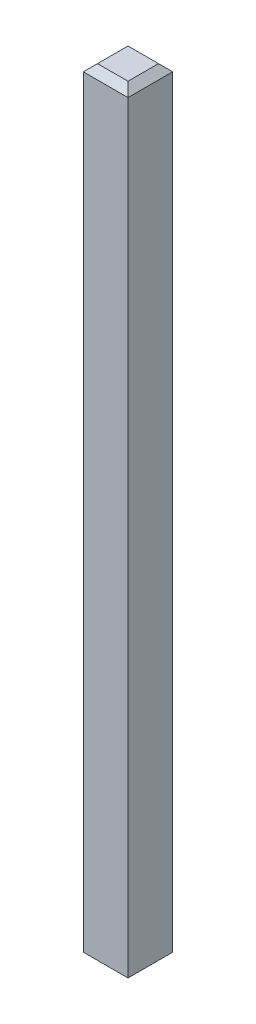
ISO-10303-21;
HEADER;
FILE_DESCRIPTION(('STEP AP214'),'2;1');
FILE_NAME('part.step','',(''),(''),'','','');
FILE_SCHEMA(('AUTOMOTIVE_DESIGN { 1 0 10303 214 1 1 1 1 }'));
ENDSEC;
DATA;
#1=APPLICATION_CONTEXT('core data for automotive mechanical design processes');
#2=APPLICATION_PROTOCOL_DEFINITION('international standard','automotive_design',2000,#1);
#3=PRODUCT_CONTEXT('',#1,'mechanical');
#4=PRODUCT('Part','Part','',(#3));
#5=PRODUCT_RELATED_PRODUCT_CATEGORY('part','',(#4));
#6=PRODUCT_DEFINITION_FORMATION('','',#4);
#7=PRODUCT_DEFINITION_CONTEXT('part definition',#1,'design');
#8=PRODUCT_DEFINITION('design','',#6,#7);
#9=PRODUCT_DEFINITION_SHAPE('','',#8);
#10=(LENGTH_UNIT() NAMED_UNIT(*) SI_UNIT(.MILLI.,.METRE.));
#11=(NAMED_UNIT(*) PLANE_ANGLE_UNIT() SI_UNIT($,.RADIAN.));
#12=(NAMED_UNIT(*) SI_UNIT($,.STERADIAN.) SOLID_ANGLE_UNIT());
#13=UNCERTAINTY_MEASURE_WITH_UNIT(LENGTH_MEASURE(1.E-05),#10,'distance_accuracy_value','');
#14=(GEOMETRIC_REPRESENTATION_CONTEXT(3) GLOBAL_UNCERTAINTY_ASSIGNED_CONTEXT((#13)) GLOBAL_UNIT_ASSIGNED_CONTEXT((#10,
#11,#12)) REPRESENTATION_CONTEXT('',''));
#15=CARTESIAN_POINT('',(0.,0.,0.));
#16=DIRECTION('',(0.,0.,1.));
#17=DIRECTION('',(1.,0.,0.));
#18=AXIS2_PLACEMENT_3D('',#15,#16,#17);
#19=CARTESIAN_POINT('',(0.,10.95,0.215));
#20=DIRECTION('',(0.,0.707106781186545,0.707106781186551));
#21=DIRECTION('',(1.,0.,0.));
#22=AXIS2_PLACEMENT_3D('',#19,#20,#21);
#23=PLANE('',#22);
#24=DIRECTION('',(-0.577350269189624,-0.577350269189629,0.577350269189624));
#25=VECTOR('',#24,1.);
#26=CARTESIAN_POINT('',(-0.143333333333333,11.0216666666667,0.143333333333334));
#27=LINE('',#26,#25);
#28=CARTESIAN_POINT('',(-0.215,10.95,0.215));
#29=VERTEX_POINT('',#28);
#30=CARTESIAN_POINT('',(-0.315,10.85,0.315));
#31=VERTEX_POINT('',#30);
#32=EDGE_CURVE('E27',#29,#31,#27,.T.);
#33=ORIENTED_EDGE('',*,*,#32,.T.);
#34=DIRECTION('',(-1.,0.,0.));
#35=VECTOR('',#34,1.);
#36=CARTESIAN_POINT('',(-0.315,10.85,0.315));
#37=LINE('',#36,#35);
#38=CARTESIAN_POINT('',(0.315,10.85,0.315));
#39=VERTEX_POINT('',#38);
#40=EDGE_CURVE('E138',#39,#31,#37,.T.);
#41=ORIENTED_EDGE('',*,*,#40,.F.);
#42=DIRECTION('',(-0.577350269189624,0.577350269189629,-0.577350269189624));
#43=VECTOR('',#42,1.);
#44=CARTESIAN_POINT('',(0.143333333333334,11.0216666666667,0.143333333333334));
#45=LINE('',#44,#43);
#46=CARTESIAN_POINT('',(0.215,10.95,0.215));
#47=VERTEX_POINT('',#46);
#48=EDGE_CURVE('E11',#39,#47,#45,.T.);
#49=ORIENTED_EDGE('',*,*,#48,.T.);
#50=DIRECTION('',(1.,0.,0.));
#51=VECTOR('',#50,1.);
#52=CARTESIAN_POINT('',(0.315,10.95,0.215));
#53=LINE('',#52,#51);
#54=EDGE_CURVE('E141',#29,#47,#53,.T.);
#55=ORIENTED_EDGE('',*,*,#54,.F.);
#56=EDGE_LOOP('',(#33,#41,#49,#55));
#57=FACE_BOUND('',#56,.T.);
#58=ADVANCED_FACE('F17',(#57),#23,.T.);
#59=CARTESIAN_POINT('',(0.215,10.95,0.));
#60=DIRECTION('',(0.707106781186551,0.707106781186545,0.));
#61=DIRECTION('',(0.,0.,-1.));
#62=AXIS2_PLACEMENT_3D('',#59,#60,#61);
#63=PLANE('',#62);
#64=DIRECTION('',(-0.577350269189624,0.577350269189629,0.577350269189624));
#65=VECTOR('',#64,1.);
#66=CARTESIAN_POINT('',(0.143333333333334,11.0216666666667,-0.143333333333334));
#67=LINE('',#66,#65);
#68=CARTESIAN_POINT('',(0.315,10.85,-0.315));
#69=VERTEX_POINT('',#68);
#70=CARTESIAN_POINT('',(0.215,10.95,-0.215));
#71=VERTEX_POINT('',#70);
#72=EDGE_CURVE('E89',#69,#71,#67,.T.);
#73=ORIENTED_EDGE('',*,*,#72,.T.);
#74=DIRECTION('',(0.,0.,-1.));
#75=VECTOR('',#74,1.);
#76=CARTESIAN_POINT('',(0.215,10.95,-0.315));
#77=LINE('',#76,#75);
#78=EDGE_CURVE('E112',#47,#71,#77,.T.);
#79=ORIENTED_EDGE('',*,*,#78,.F.);
#80=ORIENTED_EDGE('',*,*,#48,.F.);
#81=DIRECTION('',(0.,0.,1.));
#82=VECTOR('',#81,1.);
#83=CARTESIAN_POINT('',(0.315,10.85,0.315));
#84=LINE('',#83,#82);
#85=EDGE_CURVE('E283',#69,#39,#84,.T.);
#86=ORIENTED_EDGE('',*,*,#85,.F.);
#87=EDGE_LOOP('',(#73,#79,#80,#86));
#88=FACE_BOUND('',#87,.T.);
#89=ADVANCED_FACE('F19',(#88),#63,.T.);
#90=CARTESIAN_POINT('',(-0.215,10.95,0.));
#91=DIRECTION('',(-0.707106781186551,0.707106781186545,0.));
#92=DIRECTION('',(0.,0.,1.));
#93=AXIS2_PLACEMENT_3D('',#90,#91,#92);
#94=PLANE('',#93);
#95=DIRECTION('',(-0.577350269189624,-0.577350269189629,-0.577350269189624));
#96=VECTOR('',#95,1.);
#97=CARTESIAN_POINT('',(-0.143333333333333,11.0216666666667,-0.143333333333334));
#98=LINE('',#97,#96);
#99=CARTESIAN_POINT('',(-0.215,10.95,-0.215));
#100=VERTEX_POINT('',#99);
#101=CARTESIAN_POINT('',(-0.315,10.85,-0.315));
#102=VERTEX_POINT('',#101);
#103=EDGE_CURVE('E127',#100,#102,#98,.T.);
#104=ORIENTED_EDGE('',*,*,#103,.T.);
#105=DIRECTION('',(0.,0.,-1.));
#106=VECTOR('',#105,1.);
#107=CARTESIAN_POINT('',(-0.315,10.85,-0.315));
#108=LINE('',#107,#106);
#109=EDGE_CURVE('E160',#31,#102,#108,.T.);
#110=ORIENTED_EDGE('',*,*,#109,.F.);
#111=ORIENTED_EDGE('',*,*,#32,.F.);
#112=DIRECTION('',(0.,0.,1.));
#113=VECTOR('',#112,1.);
#114=CARTESIAN_POINT('',(-0.215,10.95,0.315));
#115=LINE('',#114,#113);
#116=EDGE_CURVE('E156',#100,#29,#115,.T.);
#117=ORIENTED_EDGE('',*,*,#116,.F.);
#118=EDGE_LOOP('',(#104,#110,#111,#117));
#119=FACE_BOUND('',#118,.T.);
#120=ADVANCED_FACE('F161',(#119),#94,.T.);
#121=CARTESIAN_POINT('',(0.,10.95,-0.215));
#122=DIRECTION('',(0.,0.707106781186545,-0.707106781186551));
#123=DIRECTION('',(-1.,0.,0.));
#124=AXIS2_PLACEMENT_3D('',#121,#122,#123);
#125=PLANE('',#124);
#126=ORIENTED_EDGE('',*,*,#72,.F.);
#127=DIRECTION('',(1.,0.,0.));
#128=VECTOR('',#127,1.);
#129=CARTESIAN_POINT('',(0.315,10.85,-0.315));
#130=LINE('',#129,#128);
#131=EDGE_CURVE('E173',#102,#69,#130,.T.);
#132=ORIENTED_EDGE('',*,*,#131,.F.);
#133=ORIENTED_EDGE('',*,*,#103,.F.);
#134=DIRECTION('',(-1.,0.,0.));
#135=VECTOR('',#134,1.);
#136=CARTESIAN_POINT('',(-0.315,10.95,-0.215));
#137=LINE('',#136,#135);
#138=EDGE_CURVE('E105',#71,#100,#137,.T.);
#139=ORIENTED_EDGE('',*,*,#138,.F.);
#140=EDGE_LOOP('',(#126,#132,#133,#139));
#141=FACE_BOUND('',#140,.T.);
#142=ADVANCED_FACE('F365',(#141),#125,.T.);
#143=CARTESIAN_POINT('',(-0.315,0.1,-0.315));
#144=DIRECTION('',(0.,0.707106781186542,0.707106781186554));
#145=DIRECTION('',(1.,0.,0.));
#146=AXIS2_PLACEMENT_3D('',#143,#144,#145);
#147=PLANE('',#146);
#148=DIRECTION('',(-0.577350269189622,-0.577350269189633,0.577350269189623));
#149=VECTOR('',#148,1.);
#150=CARTESIAN_POINT('',(0.315,0.1,-0.315));
#151=LINE('',#150,#149);
#152=CARTESIAN_POINT('',(0.315,0.1,-0.315));
#153=VERTEX_POINT('',#152);
#154=CARTESIAN_POINT('',(0.215,0.,-0.215));
#155=VERTEX_POINT('',#154);
#156=EDGE_CURVE('E90',#153,#155,#151,.T.);
#157=ORIENTED_EDGE('',*,*,#156,.T.);
#158=DIRECTION('',(1.,0.,0.));
#159=VECTOR('',#158,1.);
#160=CARTESIAN_POINT('',(0.,0.,-0.215));
#161=LINE('',#160,#159);
#162=CARTESIAN_POINT('',(-0.215,0.,-0.215));
#163=VERTEX_POINT('',#162);
#164=EDGE_CURVE('E93',#163,#155,#161,.T.);
#165=ORIENTED_EDGE('',*,*,#164,.F.);
#166=DIRECTION('',(-0.577350269189622,0.577350269189632,-0.577350269189622));
#167=VECTOR('',#166,1.);
#168=CARTESIAN_POINT('',(-0.315,0.1,-0.315));
#169=LINE('',#168,#167);
#170=CARTESIAN_POINT('',(-0.315,0.1,-0.315));
#171=VERTEX_POINT('',#170);
#172=EDGE_CURVE('E77',#163,#171,#169,.T.);
#173=ORIENTED_EDGE('',*,*,#172,.T.);
#174=DIRECTION('',(-1.,0.,0.));
#175=VECTOR('',#174,1.);
#176=CARTESIAN_POINT('',(-0.315,0.1,-0.315));
#177=LINE('',#176,#175);
#178=EDGE_CURVE('E280',#153,#171,#177,.T.);
#179=ORIENTED_EDGE('',*,*,#178,.F.);
#180=EDGE_LOOP('',(#157,#165,#173,#179));
#181=FACE_BOUND('',#180,.T.);
#182=ADVANCED_FACE('F94',(#181),#147,.F.);
#183=CARTESIAN_POINT('',(-0.315,0.1,-0.315));
#184=DIRECTION('',(0.707106781186554,0.707106781186542,0.));
#185=DIRECTION('',(0.,0.,-1.));
#186=AXIS2_PLACEMENT_3D('',#183,#184,#185);
#187=PLANE('',#186);
#188=DIRECTION('',(-0.577350269189622,0.577350269189633,0.577350269189623));
#189=VECTOR('',#188,1.);
#190=CARTESIAN_POINT('',(-0.315,0.1,0.315));
#191=LINE('',#190,#189);
#192=CARTESIAN_POINT('',(-0.215,0.,0.215));
#193=VERTEX_POINT('',#192);
#194=CARTESIAN_POINT('',(-0.315,0.1,0.315));
#195=VERTEX_POINT('',#194);
#196=EDGE_CURVE('E120',#193,#195,#191,.T.);
#197=ORIENTED_EDGE('',*,*,#196,.T.);
#198=DIRECTION('',(0.,0.,1.));
#199=VECTOR('',#198,1.);
#200=CARTESIAN_POINT('',(-0.315,0.1,-0.315));
#201=LINE('',#200,#199);
#202=EDGE_CURVE('E84',#171,#195,#201,.T.);
#203=ORIENTED_EDGE('',*,*,#202,.F.);
#204=ORIENTED_EDGE('',*,*,#172,.F.);
#205=DIRECTION('',(0.,0.,-1.));
#206=VECTOR('',#205,1.);
#207=CARTESIAN_POINT('',(-0.215,0.,0.));
#208=LINE('',#207,#206);
#209=EDGE_CURVE('E82',#193,#163,#208,.T.);
#210=ORIENTED_EDGE('',*,*,#209,.F.);
#211=EDGE_LOOP('',(#197,#203,#204,#210));
#212=FACE_BOUND('',#211,.T.);
#213=ADVANCED_FACE('F80',(#212),#187,.F.);
#214=CARTESIAN_POINT('',(0.315,0.1,-0.315));
#215=DIRECTION('',(-0.707106781186554,0.707106781186542,0.));
#216=DIRECTION('',(0.,0.,1.));
#217=AXIS2_PLACEMENT_3D('',#214,#215,#216);
#218=PLANE('',#217);
#219=DIRECTION('',(-0.577350269189622,-0.577350269189632,-0.577350269189622));
#220=VECTOR('',#219,1.);
#221=CARTESIAN_POINT('',(0.105000000000002,-0.11,0.105000000000002));
#222=LINE('',#221,#220);
#223=CARTESIAN_POINT('',(0.315,0.1,0.315));
#224=VERTEX_POINT('',#223);
#225=CARTESIAN_POINT('',(0.215,0.,0.215));
#226=VERTEX_POINT('',#225);
#227=EDGE_CURVE('E40',#224,#226,#222,.T.);
#228=ORIENTED_EDGE('',*,*,#227,.T.);
#229=DIRECTION('',(0.,0.,1.));
#230=VECTOR('',#229,1.);
#231=CARTESIAN_POINT('',(0.215,0.,0.));
#232=LINE('',#231,#230);
#233=EDGE_CURVE('E99',#155,#226,#232,.T.);
#234=ORIENTED_EDGE('',*,*,#233,.F.);
#235=ORIENTED_EDGE('',*,*,#156,.F.);
#236=DIRECTION('',(0.,0.,-1.));
#237=VECTOR('',#236,1.);
#238=CARTESIAN_POINT('',(0.315,0.1,-0.315));
#239=LINE('',#238,#237);
#240=EDGE_CURVE('E294',#224,#153,#239,.T.);
#241=ORIENTED_EDGE('',*,*,#240,.F.);
#242=EDGE_LOOP('',(#228,#234,#235,#241));
#243=FACE_BOUND('',#242,.T.);
#244=ADVANCED_FACE('F360',(#243),#218,.F.);
#245=CARTESIAN_POINT('',(-0.315,0.1,0.315));
#246=DIRECTION('',(0.,0.707106781186542,-0.707106781186554));
#247=DIRECTION('',(-1.,0.,0.));
#248=AXIS2_PLACEMENT_3D('',#245,#246,#247);
#249=PLANE('',#248);
#250=ORIENTED_EDGE('',*,*,#196,.F.);
#251=DIRECTION('',(-1.,0.,0.));
#252=VECTOR('',#251,1.);
#253=CARTESIAN_POINT('',(0.,0.,0.215));
#254=LINE('',#253,#252);
#255=EDGE_CURVE('E103',#226,#193,#254,.T.);
#256=ORIENTED_EDGE('',*,*,#255,.F.);
#257=ORIENTED_EDGE('',*,*,#227,.F.);
#258=DIRECTION('',(1.,0.,0.));
#259=VECTOR('',#258,1.);
#260=CARTESIAN_POINT('',(-0.315,0.1,0.315));
#261=LINE('',#260,#259);
#262=EDGE_CURVE('E157',#195,#224,#261,.T.);
#263=ORIENTED_EDGE('',*,*,#262,.F.);
#264=EDGE_LOOP('',(#250,#256,#257,#263));
#265=FACE_BOUND('',#264,.T.);
#266=ADVANCED_FACE('F359',(#265),#249,.F.);
#267=CARTESIAN_POINT('',(0.,0.,0.));
#268=DIRECTION('',(0.,1.,0.));
#269=DIRECTION('',(1.,0.,0.));
#270=AXIS2_PLACEMENT_3D('',#267,#268,#269);
#271=PLANE('',#270);
#272=ORIENTED_EDGE('',*,*,#209,.T.);
#273=ORIENTED_EDGE('',*,*,#164,.T.);
#274=ORIENTED_EDGE('',*,*,#233,.T.);
#275=ORIENTED_EDGE('',*,*,#255,.T.);
#276=EDGE_LOOP('',(#272,#273,#274,#275));
#277=FACE_BOUND('',#276,.T.);
#278=ADVANCED_FACE('F102',(#277),#271,.F.);
#279=CARTESIAN_POINT('',(0.,10.95,0.));
#280=DIRECTION('',(0.,1.,0.));
#281=DIRECTION('',(1.,0.,0.));
#282=AXIS2_PLACEMENT_3D('',#279,#280,#281);
#283=PLANE('',#282);
#284=ORIENTED_EDGE('',*,*,#116,.T.);
#285=ORIENTED_EDGE('',*,*,#54,.T.);
#286=ORIENTED_EDGE('',*,*,#78,.T.);
#287=ORIENTED_EDGE('',*,*,#138,.T.);
#288=EDGE_LOOP('',(#284,#285,#286,#287));
#289=FACE_BOUND('',#288,.T.);
#290=ADVANCED_FACE('F366',(#289),#283,.T.);
#291=CARTESIAN_POINT('',(-0.315,10.95,0.315));
#292=DIRECTION('',(0.,0.,-1.));
#293=DIRECTION('',(0.,-1.,0.));
#294=AXIS2_PLACEMENT_3D('',#291,#292,#293);
#295=PLANE('',#294);
#296=DIRECTION('',(0.,-1.,0.));
#297=VECTOR('',#296,1.);
#298=CARTESIAN_POINT('',(-0.315,10.95,0.315));
#299=LINE('',#298,#297);
#300=EDGE_CURVE('E152',#31,#195,#299,.T.);
#301=ORIENTED_EDGE('',*,*,#300,.T.);
#302=ORIENTED_EDGE('',*,*,#262,.T.);
#303=DIRECTION('',(0.,-1.,0.));
#304=VECTOR('',#303,1.);
#305=CARTESIAN_POINT('',(0.315,10.95,0.315));
#306=LINE('',#305,#304);
#307=EDGE_CURVE('E154',#39,#224,#306,.T.);
#308=ORIENTED_EDGE('',*,*,#307,.F.);
#309=ORIENTED_EDGE('',*,*,#40,.T.);
#310=EDGE_LOOP('',(#301,#302,#308,#309));
#311=FACE_BOUND('',#310,.T.);
#312=ADVANCED_FACE('F149',(#311),#295,.F.);
#313=CARTESIAN_POINT('',(-0.315,10.95,-0.315));
#314=DIRECTION('',(1.,0.,0.));
#315=DIRECTION('',(0.,0.,-1.));
#316=AXIS2_PLACEMENT_3D('',#313,#314,#315);
#317=PLANE('',#316);
#318=DIRECTION('',(0.,-1.,0.));
#319=VECTOR('',#318,1.);
#320=CARTESIAN_POINT('',(-0.315,10.95,-0.315));
#321=LINE('',#320,#319);
#322=EDGE_CURVE('E191',#102,#171,#321,.T.);
#323=ORIENTED_EDGE('',*,*,#322,.T.);
#324=ORIENTED_EDGE('',*,*,#202,.T.);
#325=ORIENTED_EDGE('',*,*,#300,.F.);
#326=ORIENTED_EDGE('',*,*,#109,.T.);
#327=EDGE_LOOP('',(#323,#324,#325,#326));
#328=FACE_BOUND('',#327,.T.);
#329=ADVANCED_FACE('F167',(#328),#317,.F.);
#330=CARTESIAN_POINT('',(-0.315,10.95,-0.315));
#331=DIRECTION('',(0.,0.,1.));
#332=DIRECTION('',(1.,0.,0.));
#333=AXIS2_PLACEMENT_3D('',#330,#331,#332);
#334=PLANE('',#333);
#335=DIRECTION('',(0.,-1.,0.));
#336=VECTOR('',#335,1.);
#337=CARTESIAN_POINT('',(0.315,10.95,-0.315));
#338=LINE('',#337,#336);
#339=EDGE_CURVE('E287',#69,#153,#338,.T.);
#340=ORIENTED_EDGE('',*,*,#339,.T.);
#341=ORIENTED_EDGE('',*,*,#178,.T.);
#342=ORIENTED_EDGE('',*,*,#322,.F.);
#343=ORIENTED_EDGE('',*,*,#131,.T.);
#344=EDGE_LOOP('',(#340,#341,#342,#343));
#345=FACE_BOUND('',#344,.T.);
#346=ADVANCED_FACE('F363',(#345),#334,.F.);
#347=CARTESIAN_POINT('',(0.315,10.95,-0.315));
#348=DIRECTION('',(-1.,0.,0.));
#349=DIRECTION('',(0.,1.,0.));
#350=AXIS2_PLACEMENT_3D('',#347,#348,#349);
#351=PLANE('',#350);
#352=ORIENTED_EDGE('',*,*,#307,.T.);
#353=ORIENTED_EDGE('',*,*,#240,.T.);
#354=ORIENTED_EDGE('',*,*,#339,.F.);
#355=ORIENTED_EDGE('',*,*,#85,.T.);
#356=EDGE_LOOP('',(#352,#353,#354,#355));
#357=FACE_BOUND('',#356,.T.);
#358=ADVANCED_FACE('F326',(#357),#351,.F.);
#359=CLOSED_SHELL('',(#58,#89,#120,#142,#182,#213,#244,#266,#278,#290,#312,#329,#346,#358));
#360=MANIFOLD_SOLID_BREP('B1',#359);
#361=ADVANCED_BREP_SHAPE_REPRESENTATION('',(#18,#360),#14);
#362=SHAPE_DEFINITION_REPRESENTATION(#9,#361);
ENDSEC;
END-ISO-10303-21;
